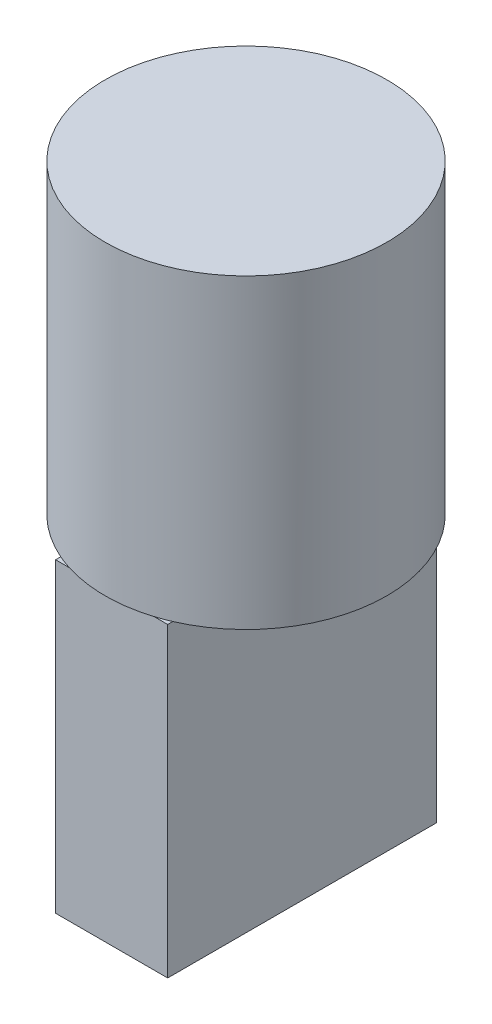
ISO-10303-21;
HEADER;
FILE_DESCRIPTION(('STEP AP214'),'2;1');
FILE_NAME('part.step','',(''),(''),'','','');
FILE_SCHEMA(('AUTOMOTIVE_DESIGN { 1 0 10303 214 1 1 1 1 }'));
ENDSEC;
DATA;
#1=APPLICATION_CONTEXT('core data for automotive mechanical design processes');
#2=APPLICATION_PROTOCOL_DEFINITION('international standard','automotive_design',2000,#1);
#3=PRODUCT_CONTEXT('',#1,'mechanical');
#4=PRODUCT('Part','Part','',(#3));
#5=PRODUCT_RELATED_PRODUCT_CATEGORY('part','',(#4));
#6=PRODUCT_DEFINITION_FORMATION('','',#4);
#7=PRODUCT_DEFINITION_CONTEXT('part definition',#1,'design');
#8=PRODUCT_DEFINITION('design','',#6,#7);
#9=PRODUCT_DEFINITION_SHAPE('','',#8);
#10=(LENGTH_UNIT() NAMED_UNIT(*) SI_UNIT(.MILLI.,.METRE.));
#11=(NAMED_UNIT(*) PLANE_ANGLE_UNIT() SI_UNIT($,.RADIAN.));
#12=(NAMED_UNIT(*) SI_UNIT($,.STERADIAN.) SOLID_ANGLE_UNIT());
#13=UNCERTAINTY_MEASURE_WITH_UNIT(LENGTH_MEASURE(1.E-05),#10,'distance_accuracy_value','');
#14=(GEOMETRIC_REPRESENTATION_CONTEXT(3) GLOBAL_UNCERTAINTY_ASSIGNED_CONTEXT((#13)) GLOBAL_UNIT_ASSIGNED_CONTEXT((#10,
#11,#12)) REPRESENTATION_CONTEXT('',''));
#15=CARTESIAN_POINT('',(0.,0.,0.));
#16=DIRECTION('',(0.,0.,1.));
#17=DIRECTION('',(1.,0.,0.));
#18=AXIS2_PLACEMENT_3D('',#15,#16,#17);
#19=CARTESIAN_POINT('',(0.,0.,0.));
#20=DIRECTION('',(0.,1.,0.));
#21=DIRECTION('',(0.,0.,1.));
#22=AXIS2_PLACEMENT_3D('',#19,#20,#21);
#23=PLANE('',#22);
#24=DIRECTION('',(0.,0.,1.));
#25=VECTOR('',#24,1.);
#26=CARTESIAN_POINT('',(7.68758187762682,0.,18.4288421121997));
#27=LINE('',#26,#25);
#28=CARTESIAN_POINT('',(7.68758187762682,0.,-17.7246575389987));
#29=VERTEX_POINT('',#28);
#30=CARTESIAN_POINT('',(7.68758187762682,0.,17.7246575389987));
#31=VERTEX_POINT('',#30);
#32=EDGE_CURVE('E11',#29,#31,#27,.T.);
#33=ORIENTED_EDGE('',*,*,#32,.F.);
#34=CARTESIAN_POINT('',(0.,0.,0.));
#35=DIRECTION('',(0.,1.,0.));
#36=DIRECTION('',(0.,0.,1.));
#37=AXIS2_PLACEMENT_3D('',#34,#35,#36);
#38=CIRCLE('',#37,19.32);
#39=EDGE_CURVE('E147',#31,#29,#38,.T.);
#40=ORIENTED_EDGE('',*,*,#39,.F.);
#41=EDGE_LOOP('',(#33,#40));
#42=FACE_BOUND('',#41,.T.);
#43=ADVANCED_FACE('F37',(#42),#23,.F.);
#44=DIRECTION('',(1.,0.,0.));
#45=VECTOR('',#44,1.);
#46=CARTESIAN_POINT('',(-7.68758187762682,0.,-18.4288421121997));
#47=LINE('',#46,#45);
#48=CARTESIAN_POINT('',(-5.80001537960149,0.,-18.4288421121997));
#49=VERTEX_POINT('',#48);
#50=CARTESIAN_POINT('',(5.80001537960149,0.,-18.4288421121997));
#51=VERTEX_POINT('',#50);
#52=EDGE_CURVE('E46',#49,#51,#47,.T.);
#53=ORIENTED_EDGE('',*,*,#52,.F.);
#54=EDGE_CURVE('E154',#51,#49,#38,.T.);
#55=ORIENTED_EDGE('',*,*,#54,.F.);
#56=EDGE_LOOP('',(#53,#55));
#57=FACE_BOUND('',#56,.T.);
#58=ADVANCED_FACE('F203',(#57),#23,.F.);
#59=DIRECTION('',(0.,0.,-1.));
#60=VECTOR('',#59,1.);
#61=CARTESIAN_POINT('',(-7.68758187762682,0.,18.4288421121997));
#62=LINE('',#61,#60);
#63=CARTESIAN_POINT('',(-7.68758187762682,0.,17.7246575389987));
#64=VERTEX_POINT('',#63);
#65=CARTESIAN_POINT('',(-7.68758187762682,0.,-17.7246575389987));
#66=VERTEX_POINT('',#65);
#67=EDGE_CURVE('E55',#64,#66,#62,.T.);
#68=ORIENTED_EDGE('',*,*,#67,.F.);
#69=EDGE_CURVE('E58',#66,#64,#38,.T.);
#70=ORIENTED_EDGE('',*,*,#69,.F.);
#71=EDGE_LOOP('',(#68,#70));
#72=FACE_BOUND('',#71,.T.);
#73=ADVANCED_FACE('F208',(#72),#23,.F.);
#74=DIRECTION('',(-1.,0.,0.));
#75=VECTOR('',#74,1.);
#76=CARTESIAN_POINT('',(-7.68758187762682,0.,18.4288421121997));
#77=LINE('',#76,#75);
#78=CARTESIAN_POINT('',(5.80001537960149,0.,18.4288421121997));
#79=VERTEX_POINT('',#78);
#80=CARTESIAN_POINT('',(-5.80001537960149,0.,18.4288421121997));
#81=VERTEX_POINT('',#80);
#82=EDGE_CURVE('E139',#79,#81,#77,.T.);
#83=ORIENTED_EDGE('',*,*,#82,.F.);
#84=EDGE_CURVE('E130',#81,#79,#38,.T.);
#85=ORIENTED_EDGE('',*,*,#84,.F.);
#86=EDGE_LOOP('',(#83,#85));
#87=FACE_BOUND('',#86,.T.);
#88=ADVANCED_FACE('F167',(#87),#23,.F.);
#89=CARTESIAN_POINT('',(0.,42.,0.));
#90=DIRECTION('',(0.,-1.,0.));
#91=DIRECTION('',(0.,0.,-1.));
#92=AXIS2_PLACEMENT_3D('',#89,#90,#91);
#93=CYLINDRICAL_SURFACE('',#92,19.32);
#94=CARTESIAN_POINT('',(0.,42.,0.));
#95=DIRECTION('',(0.,1.,0.));
#96=DIRECTION('',(0.,0.,1.));
#97=AXIS2_PLACEMENT_3D('',#94,#95,#96);
#98=CIRCLE('',#97,19.32);
#99=CARTESIAN_POINT('',(0.,42.,19.32));
#100=VERTEX_POINT('',#99);
#101=EDGE_CURVE('E137',#100,#100,#98,.T.);
#102=ORIENTED_EDGE('',*,*,#101,.F.);
#103=EDGE_LOOP('',(#102));
#104=FACE_BOUND('',#103,.T.);
#105=EDGE_CURVE('E41',#79,#31,#38,.T.);
#106=ORIENTED_EDGE('',*,*,#105,.T.);
#107=ORIENTED_EDGE('',*,*,#39,.T.);
#108=EDGE_CURVE('E151',#29,#51,#38,.T.);
#109=ORIENTED_EDGE('',*,*,#108,.T.);
#110=ORIENTED_EDGE('',*,*,#54,.T.);
#111=EDGE_CURVE('E157',#49,#66,#38,.T.);
#112=ORIENTED_EDGE('',*,*,#111,.T.);
#113=ORIENTED_EDGE('',*,*,#69,.T.);
#114=EDGE_CURVE('E133',#64,#81,#38,.T.);
#115=ORIENTED_EDGE('',*,*,#114,.T.);
#116=ORIENTED_EDGE('',*,*,#84,.T.);
#117=EDGE_LOOP('',(#106,#107,#109,#110,#112,#113,#115,#116));
#118=FACE_BOUND('',#117,.T.);
#119=ADVANCED_FACE('F39',(#104,#118),#93,.T.);
#120=CARTESIAN_POINT('',(0.,42.,0.));
#121=DIRECTION('',(0.,1.,0.));
#122=DIRECTION('',(0.,0.,1.));
#123=AXIS2_PLACEMENT_3D('',#120,#121,#122);
#124=PLANE('',#123);
#125=ORIENTED_EDGE('',*,*,#101,.T.);
#126=EDGE_LOOP('',(#125));
#127=FACE_BOUND('',#126,.T.);
#128=ADVANCED_FACE('F199',(#127),#124,.T.);
#129=CARTESIAN_POINT('',(0.,0.,0.));
#130=DIRECTION('',(0.,-1.,0.));
#131=DIRECTION('',(0.,0.,-1.));
#132=AXIS2_PLACEMENT_3D('',#129,#130,#131);
#133=PLANE('',#132);
#134=ORIENTED_EDGE('',*,*,#105,.F.);
#135=CARTESIAN_POINT('',(7.68758187762682,0.,18.4288421121997));
#136=VERTEX_POINT('',#135);
#137=EDGE_CURVE('E144',#136,#79,#77,.T.);
#138=ORIENTED_EDGE('',*,*,#137,.F.);
#139=EDGE_CURVE('E49',#31,#136,#27,.T.);
#140=ORIENTED_EDGE('',*,*,#139,.F.);
#141=EDGE_LOOP('',(#134,#138,#140));
#142=FACE_BOUND('',#141,.T.);
#143=ADVANCED_FACE('F193',(#142),#133,.F.);
#144=ORIENTED_EDGE('',*,*,#108,.F.);
#145=CARTESIAN_POINT('',(7.68758187762682,0.,-18.4288421121997));
#146=VERTEX_POINT('',#145);
#147=EDGE_CURVE('E48',#146,#29,#27,.T.);
#148=ORIENTED_EDGE('',*,*,#147,.F.);
#149=EDGE_CURVE('E175',#51,#146,#47,.T.);
#150=ORIENTED_EDGE('',*,*,#149,.F.);
#151=EDGE_LOOP('',(#144,#148,#150));
#152=FACE_BOUND('',#151,.T.);
#153=ADVANCED_FACE('F191',(#152),#133,.F.);
#154=ORIENTED_EDGE('',*,*,#111,.F.);
#155=CARTESIAN_POINT('',(-7.68758187762682,0.,-18.4288421121997));
#156=VERTEX_POINT('',#155);
#157=EDGE_CURVE('E124',#156,#49,#47,.T.);
#158=ORIENTED_EDGE('',*,*,#157,.F.);
#159=EDGE_CURVE('E171',#66,#156,#62,.T.);
#160=ORIENTED_EDGE('',*,*,#159,.F.);
#161=EDGE_LOOP('',(#154,#158,#160));
#162=FACE_BOUND('',#161,.T.);
#163=ADVANCED_FACE('F187',(#162),#133,.F.);
#164=CARTESIAN_POINT('',(7.68758187762682,-42.,18.4288421121997));
#165=DIRECTION('',(-1.,0.,0.));
#166=DIRECTION('',(0.,0.,1.));
#167=AXIS2_PLACEMENT_3D('',#164,#165,#166);
#168=PLANE('',#167);
#169=ORIENTED_EDGE('',*,*,#147,.T.);
#170=ORIENTED_EDGE('',*,*,#32,.T.);
#171=ORIENTED_EDGE('',*,*,#139,.T.);
#172=DIRECTION('',(0.,1.,0.));
#173=VECTOR('',#172,1.);
#174=CARTESIAN_POINT('',(7.68758187762682,-42.,18.4288421121997));
#175=LINE('',#174,#173);
#176=CARTESIAN_POINT('',(7.68758187762682,-42.,18.4288421121997));
#177=VERTEX_POINT('',#176);
#178=EDGE_CURVE('E109',#177,#136,#175,.T.);
#179=ORIENTED_EDGE('',*,*,#178,.F.);
#180=DIRECTION('',(0.,0.,1.));
#181=VECTOR('',#180,1.);
#182=CARTESIAN_POINT('',(7.68758187762682,-42.,18.4288421121997));
#183=LINE('',#182,#181);
#184=CARTESIAN_POINT('',(7.68758187762682,-42.,-18.4288421121997));
#185=VERTEX_POINT('',#184);
#186=EDGE_CURVE('E115',#185,#177,#183,.T.);
#187=ORIENTED_EDGE('',*,*,#186,.F.);
#188=DIRECTION('',(0.,1.,0.));
#189=VECTOR('',#188,1.);
#190=CARTESIAN_POINT('',(7.68758187762682,-42.,-18.4288421121997));
#191=LINE('',#190,#189);
#192=EDGE_CURVE('E178',#185,#146,#191,.T.);
#193=ORIENTED_EDGE('',*,*,#192,.T.);
#194=EDGE_LOOP('',(#169,#170,#171,#179,#187,#193));
#195=FACE_BOUND('',#194,.T.);
#196=ADVANCED_FACE('F127',(#195),#168,.F.);
#197=CARTESIAN_POINT('',(-7.68758187762682,-42.,18.4288421121997));
#198=DIRECTION('',(0.,0.,-1.));
#199=DIRECTION('',(-1.,0.,0.));
#200=AXIS2_PLACEMENT_3D('',#197,#198,#199);
#201=PLANE('',#200);
#202=ORIENTED_EDGE('',*,*,#137,.T.);
#203=ORIENTED_EDGE('',*,*,#82,.T.);
#204=CARTESIAN_POINT('',(-7.68758187762682,0.,18.4288421121997));
#205=VERTEX_POINT('',#204);
#206=EDGE_CURVE('E145',#81,#205,#77,.T.);
#207=ORIENTED_EDGE('',*,*,#206,.T.);
#208=DIRECTION('',(0.,1.,0.));
#209=VECTOR('',#208,1.);
#210=CARTESIAN_POINT('',(-7.68758187762682,-42.,18.4288421121997));
#211=LINE('',#210,#209);
#212=CARTESIAN_POINT('',(-7.68758187762682,-42.,18.4288421121997));
#213=VERTEX_POINT('',#212);
#214=EDGE_CURVE('E111',#213,#205,#211,.T.);
#215=ORIENTED_EDGE('',*,*,#214,.F.);
#216=DIRECTION('',(-1.,0.,0.));
#217=VECTOR('',#216,1.);
#218=CARTESIAN_POINT('',(-7.68758187762682,-42.,18.4288421121997));
#219=LINE('',#218,#217);
#220=EDGE_CURVE('E104',#177,#213,#219,.T.);
#221=ORIENTED_EDGE('',*,*,#220,.F.);
#222=ORIENTED_EDGE('',*,*,#178,.T.);
#223=EDGE_LOOP('',(#202,#203,#207,#215,#221,#222));
#224=FACE_BOUND('',#223,.T.);
#225=ADVANCED_FACE('F107',(#224),#201,.F.);
#226=CARTESIAN_POINT('',(-7.68758187762682,-42.,18.4288421121997));
#227=DIRECTION('',(1.,0.,0.));
#228=DIRECTION('',(0.,0.,-1.));
#229=AXIS2_PLACEMENT_3D('',#226,#227,#228);
#230=PLANE('',#229);
#231=EDGE_CURVE('E169',#205,#64,#62,.T.);
#232=ORIENTED_EDGE('',*,*,#231,.T.);
#233=ORIENTED_EDGE('',*,*,#67,.T.);
#234=ORIENTED_EDGE('',*,*,#159,.T.);
#235=DIRECTION('',(0.,1.,0.));
#236=VECTOR('',#235,1.);
#237=CARTESIAN_POINT('',(-7.68758187762682,-42.,-18.4288421121997));
#238=LINE('',#237,#236);
#239=CARTESIAN_POINT('',(-7.68758187762682,-42.,-18.4288421121997));
#240=VERTEX_POINT('',#239);
#241=EDGE_CURVE('E134',#240,#156,#238,.T.);
#242=ORIENTED_EDGE('',*,*,#241,.F.);
#243=DIRECTION('',(0.,0.,-1.));
#244=VECTOR('',#243,1.);
#245=CARTESIAN_POINT('',(-7.68758187762682,-42.,18.4288421121997));
#246=LINE('',#245,#244);
#247=EDGE_CURVE('E114',#213,#240,#246,.T.);
#248=ORIENTED_EDGE('',*,*,#247,.F.);
#249=ORIENTED_EDGE('',*,*,#214,.T.);
#250=EDGE_LOOP('',(#232,#233,#234,#242,#248,#249));
#251=FACE_BOUND('',#250,.T.);
#252=ADVANCED_FACE('F188',(#251),#230,.F.);
#253=CARTESIAN_POINT('',(-7.68758187762682,-42.,-18.4288421121997));
#254=DIRECTION('',(0.,0.,1.));
#255=DIRECTION('',(1.,0.,0.));
#256=AXIS2_PLACEMENT_3D('',#253,#254,#255);
#257=PLANE('',#256);
#258=ORIENTED_EDGE('',*,*,#157,.T.);
#259=ORIENTED_EDGE('',*,*,#52,.T.);
#260=ORIENTED_EDGE('',*,*,#149,.T.);
#261=ORIENTED_EDGE('',*,*,#192,.F.);
#262=DIRECTION('',(1.,0.,0.));
#263=VECTOR('',#262,1.);
#264=CARTESIAN_POINT('',(-7.68758187762682,-42.,-18.4288421121997));
#265=LINE('',#264,#263);
#266=EDGE_CURVE('E120',#240,#185,#265,.T.);
#267=ORIENTED_EDGE('',*,*,#266,.F.);
#268=ORIENTED_EDGE('',*,*,#241,.T.);
#269=EDGE_LOOP('',(#258,#259,#260,#261,#267,#268));
#270=FACE_BOUND('',#269,.T.);
#271=ADVANCED_FACE('F183',(#270),#257,.F.);
#272=CARTESIAN_POINT('',(0.,-42.,0.));
#273=DIRECTION('',(0.,-1.,0.));
#274=DIRECTION('',(0.,0.,-1.));
#275=AXIS2_PLACEMENT_3D('',#272,#273,#274);
#276=PLANE('',#275);
#277=ORIENTED_EDGE('',*,*,#186,.T.);
#278=ORIENTED_EDGE('',*,*,#220,.T.);
#279=ORIENTED_EDGE('',*,*,#247,.T.);
#280=ORIENTED_EDGE('',*,*,#266,.T.);
#281=EDGE_LOOP('',(#277,#278,#279,#280));
#282=FACE_BOUND('',#281,.T.);
#283=ADVANCED_FACE('F118',(#282),#276,.T.);
#284=ORIENTED_EDGE('',*,*,#114,.F.);
#285=ORIENTED_EDGE('',*,*,#231,.F.);
#286=ORIENTED_EDGE('',*,*,#206,.F.);
#287=EDGE_LOOP('',(#284,#285,#286));
#288=FACE_BOUND('',#287,.T.);
#289=ADVANCED_FACE('F168',(#288),#133,.F.);
#290=CLOSED_SHELL('',(#43,#58,#73,#88,#119,#128,#143,#153,#163,#196,#225,#252,#271,#283,#289));
#291=MANIFOLD_SOLID_BREP('B2',#290);
#292=ADVANCED_BREP_SHAPE_REPRESENTATION('',(#18,#291),#14);
#293=SHAPE_DEFINITION_REPRESENTATION(#9,#292);
ENDSEC;
END-ISO-10303-21;
